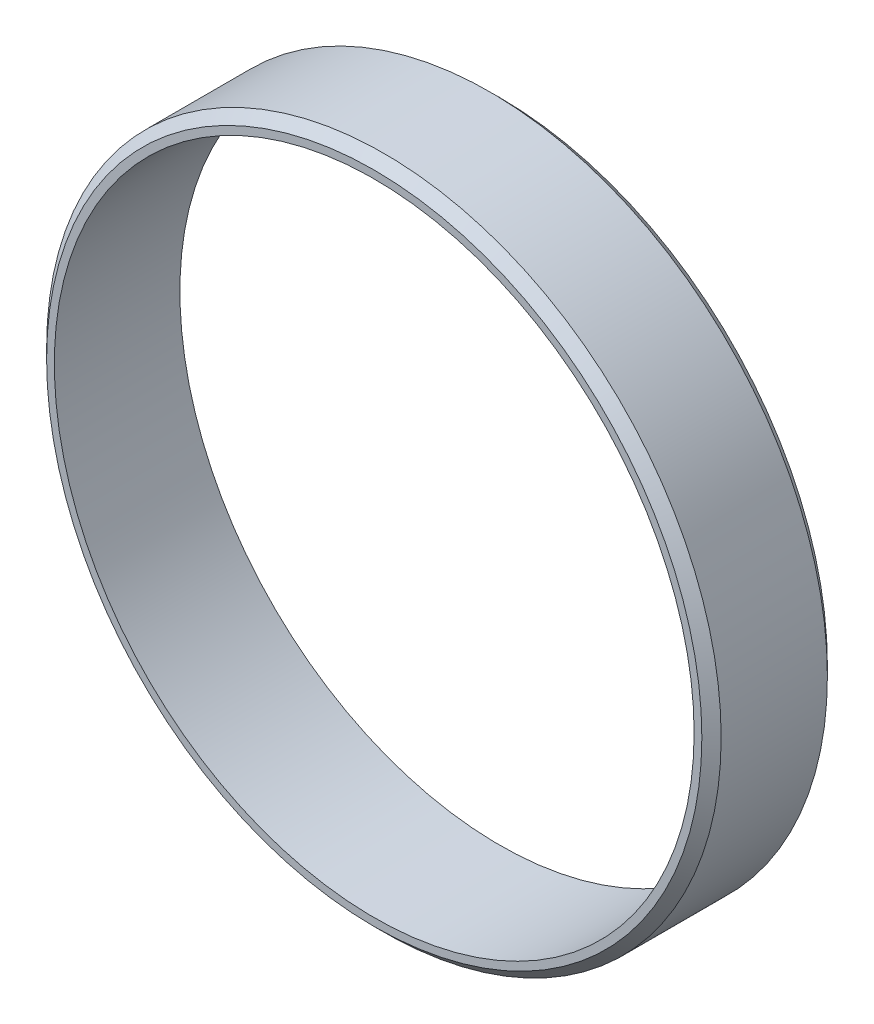
ISO-10303-21;
HEADER;
FILE_DESCRIPTION(('STEP AP214'),'2;1');
FILE_NAME('part.step','',(''),(''),'','','');
FILE_SCHEMA(('AUTOMOTIVE_DESIGN { 1 0 10303 214 1 1 1 1 }'));
ENDSEC;
DATA;
#1=APPLICATION_CONTEXT('core data for automotive mechanical design processes');
#2=APPLICATION_PROTOCOL_DEFINITION('international standard','automotive_design',2000,#1);
#3=PRODUCT_CONTEXT('',#1,'mechanical');
#4=PRODUCT('Part','Part','',(#3));
#5=PRODUCT_RELATED_PRODUCT_CATEGORY('part','',(#4));
#6=PRODUCT_DEFINITION_FORMATION('','',#4);
#7=PRODUCT_DEFINITION_CONTEXT('part definition',#1,'design');
#8=PRODUCT_DEFINITION('design','',#6,#7);
#9=PRODUCT_DEFINITION_SHAPE('','',#8);
#10=(LENGTH_UNIT() NAMED_UNIT(*) SI_UNIT(.MILLI.,.METRE.));
#11=(NAMED_UNIT(*) PLANE_ANGLE_UNIT() SI_UNIT($,.RADIAN.));
#12=(NAMED_UNIT(*) SI_UNIT($,.STERADIAN.) SOLID_ANGLE_UNIT());
#13=UNCERTAINTY_MEASURE_WITH_UNIT(LENGTH_MEASURE(1.E-05),#10,'distance_accuracy_value','');
#14=(GEOMETRIC_REPRESENTATION_CONTEXT(3) GLOBAL_UNCERTAINTY_ASSIGNED_CONTEXT((#13)) GLOBAL_UNIT_ASSIGNED_CONTEXT((#10,
#11,#12)) REPRESENTATION_CONTEXT('',''));
#15=CARTESIAN_POINT('',(0.,0.,0.));
#16=DIRECTION('',(0.,0.,1.));
#17=DIRECTION('',(1.,0.,0.));
#18=AXIS2_PLACEMENT_3D('',#15,#16,#17);
#19=CARTESIAN_POINT('',(0.,0.,0.));
#20=DIRECTION('',(0.,0.,1.));
#21=DIRECTION('',(1.,0.,0.));
#22=AXIS2_PLACEMENT_3D('',#19,#20,#21);
#23=CYLINDRICAL_SURFACE('',#22,69.85);
#24=CARTESIAN_POINT('',(0.,0.,-120.));
#25=DIRECTION('',(0.,0.,-1.));
#26=DIRECTION('',(-1.,0.,0.));
#27=AXIS2_PLACEMENT_3D('',#24,#25,#26);
#28=CIRCLE('',#27,69.85);
#29=CARTESIAN_POINT('',(-69.85,0.,-120.));
#30=VERTEX_POINT('',#29);
#31=EDGE_CURVE('E10',#30,#30,#28,.T.);
#32=ORIENTED_EDGE('',*,*,#31,.T.);
#33=EDGE_LOOP('',(#32));
#34=FACE_BOUND('',#33,.T.);
#35=CARTESIAN_POINT('',(0.,0.,-142.));
#36=DIRECTION('',(0.,0.,1.));
#37=DIRECTION('',(1.,0.,0.));
#38=AXIS2_PLACEMENT_3D('',#35,#36,#37);
#39=CIRCLE('',#38,69.85);
#40=CARTESIAN_POINT('',(69.85,0.,-142.));
#41=VERTEX_POINT('',#40);
#42=EDGE_CURVE('E46',#41,#41,#39,.T.);
#43=ORIENTED_EDGE('',*,*,#42,.T.);
#44=EDGE_LOOP('',(#43));
#45=FACE_BOUND('',#44,.T.);
#46=ADVANCED_FACE('F31',(#34,#45),#23,.T.);
#47=CARTESIAN_POINT('',(0.,-4.44089209850063E-13,-118.));
#48=DIRECTION('',(0.,0.,-1.));
#49=DIRECTION('',(-1.,0.,0.));
#50=AXIS2_PLACEMENT_3D('',#47,#48,#49);
#51=PLANE('',#50);
#52=CARTESIAN_POINT('',(0.,0.,-118.));
#53=DIRECTION('',(0.,0.,-1.));
#54=DIRECTION('',(-1.,0.,0.));
#55=AXIS2_PLACEMENT_3D('',#52,#53,#54);
#56=CIRCLE('',#55,67.85);
#57=CARTESIAN_POINT('',(-67.85,0.,-118.));
#58=VERTEX_POINT('',#57);
#59=EDGE_CURVE('E38',#58,#58,#56,.F.);
#60=ORIENTED_EDGE('',*,*,#59,.T.);
#61=EDGE_LOOP('',(#60));
#62=FACE_BOUND('',#61,.T.);
#63=CARTESIAN_POINT('',(0.,0.,-118.));
#64=DIRECTION('',(0.,0.,1.));
#65=DIRECTION('',(1.,0.,0.));
#66=AXIS2_PLACEMENT_3D('',#63,#64,#65);
#67=CIRCLE('',#66,66.25);
#68=CARTESIAN_POINT('',(66.25,0.,-118.));
#69=VERTEX_POINT('',#68);
#70=EDGE_CURVE('E51',#69,#69,#67,.T.);
#71=ORIENTED_EDGE('',*,*,#70,.F.);
#72=EDGE_LOOP('',(#71));
#73=FACE_BOUND('',#72,.T.);
#74=ADVANCED_FACE('F63',(#62,#73),#51,.F.);
#75=CARTESIAN_POINT('',(0.,0.,0.));
#76=DIRECTION('',(0.,0.,1.));
#77=DIRECTION('',(1.,0.,0.));
#78=AXIS2_PLACEMENT_3D('',#75,#76,#77);
#79=CYLINDRICAL_SURFACE('',#78,66.25);
#80=CARTESIAN_POINT('',(0.,0.,-144.));
#81=DIRECTION('',(0.,0.,1.));
#82=DIRECTION('',(1.,0.,0.));
#83=AXIS2_PLACEMENT_3D('',#80,#81,#82);
#84=CIRCLE('',#83,66.25);
#85=CARTESIAN_POINT('',(66.25,0.,-144.));
#86=VERTEX_POINT('',#85);
#87=EDGE_CURVE('E54',#86,#86,#84,.T.);
#88=ORIENTED_EDGE('',*,*,#87,.F.);
#89=EDGE_LOOP('',(#88));
#90=FACE_BOUND('',#89,.T.);
#91=ORIENTED_EDGE('',*,*,#70,.T.);
#92=EDGE_LOOP('',(#91));
#93=FACE_BOUND('',#92,.T.);
#94=ADVANCED_FACE('F60',(#90,#93),#79,.F.);
#95=CARTESIAN_POINT('',(0.,0.,-144.));
#96=DIRECTION('',(0.,0.,1.));
#97=DIRECTION('',(1.,0.,0.));
#98=AXIS2_PLACEMENT_3D('',#95,#96,#97);
#99=PLANE('',#98);
#100=CARTESIAN_POINT('',(0.,0.,-144.));
#101=DIRECTION('',(0.,0.,1.));
#102=DIRECTION('',(1.,0.,0.));
#103=AXIS2_PLACEMENT_3D('',#100,#101,#102);
#104=CIRCLE('',#103,67.85);
#105=CARTESIAN_POINT('',(67.85,0.,-144.));
#106=VERTEX_POINT('',#105);
#107=EDGE_CURVE('E42',#106,#106,#104,.F.);
#108=ORIENTED_EDGE('',*,*,#107,.T.);
#109=EDGE_LOOP('',(#108));
#110=FACE_BOUND('',#109,.T.);
#111=ORIENTED_EDGE('',*,*,#87,.T.);
#112=EDGE_LOOP('',(#111));
#113=FACE_BOUND('',#112,.T.);
#114=ADVANCED_FACE('F58',(#110,#113),#99,.F.);
#115=CARTESIAN_POINT('',(0.,0.,-142.));
#116=DIRECTION('',(0.,0.,1.));
#117=DIRECTION('',(1.,0.,0.));
#118=AXIS2_PLACEMENT_3D('',#115,#116,#117);
#119=CONICAL_SURFACE('',#118,69.85,0.785398163397445);
#120=ORIENTED_EDGE('',*,*,#107,.F.);
#121=EDGE_LOOP('',(#120));
#122=FACE_BOUND('',#121,.T.);
#123=ORIENTED_EDGE('',*,*,#42,.F.);
#124=EDGE_LOOP('',(#123));
#125=FACE_BOUND('',#124,.T.);
#126=ADVANCED_FACE('F74',(#122,#125),#119,.T.);
#127=CARTESIAN_POINT('',(0.,0.,-118.));
#128=DIRECTION('',(0.,0.,-1.));
#129=DIRECTION('',(-1.,0.,0.));
#130=AXIS2_PLACEMENT_3D('',#127,#128,#129);
#131=CONICAL_SURFACE('',#130,67.85,0.785398163397448);
#132=ORIENTED_EDGE('',*,*,#31,.F.);
#133=EDGE_LOOP('',(#132));
#134=FACE_BOUND('',#133,.T.);
#135=ORIENTED_EDGE('',*,*,#59,.F.);
#136=EDGE_LOOP('',(#135));
#137=FACE_BOUND('',#136,.T.);
#138=ADVANCED_FACE('F33',(#134,#137),#131,.T.);
#139=CLOSED_SHELL('',(#46,#74,#94,#114,#126,#138));
#140=MANIFOLD_SOLID_BREP('B2',#139);
#141=ADVANCED_BREP_SHAPE_REPRESENTATION('',(#18,#140),#14);
#142=SHAPE_DEFINITION_REPRESENTATION(#9,#141);
ENDSEC;
END-ISO-10303-21;
